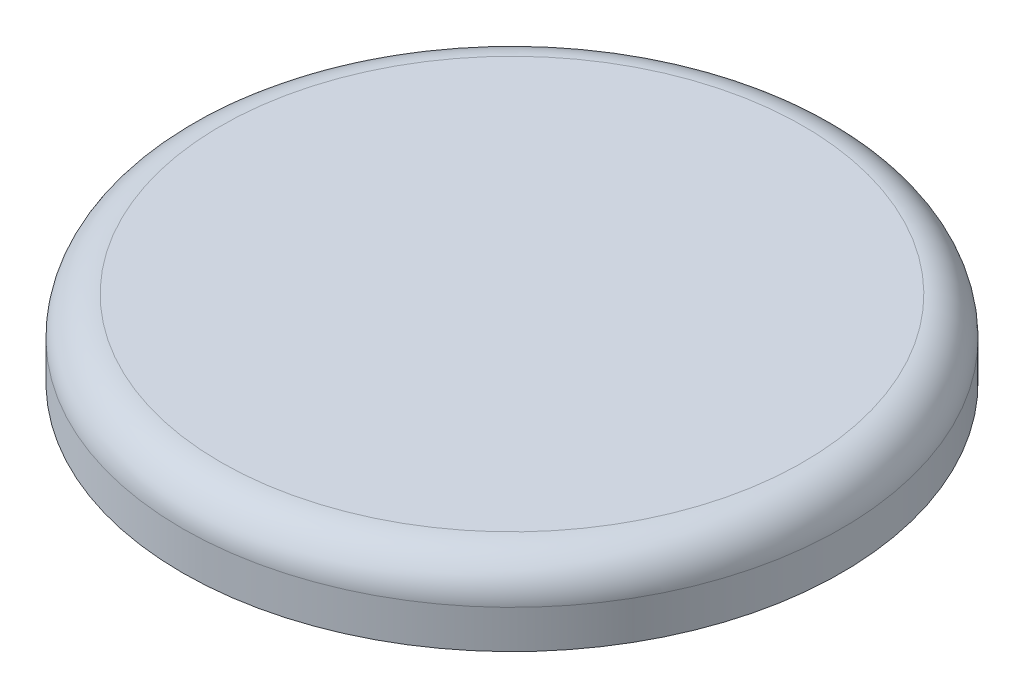
ISO-10303-21;
HEADER;
FILE_DESCRIPTION(('STEP AP214'),'2;1');
FILE_NAME('part.step','',(''),(''),'','','');
FILE_SCHEMA(('AUTOMOTIVE_DESIGN { 1 0 10303 214 1 1 1 1 }'));
ENDSEC;
DATA;
#1=APPLICATION_CONTEXT('core data for automotive mechanical design processes');
#2=APPLICATION_PROTOCOL_DEFINITION('international standard','automotive_design',2000,#1);
#3=PRODUCT_CONTEXT('',#1,'mechanical');
#4=PRODUCT('Part','Part','',(#3));
#5=PRODUCT_RELATED_PRODUCT_CATEGORY('part','',(#4));
#6=PRODUCT_DEFINITION_FORMATION('','',#4);
#7=PRODUCT_DEFINITION_CONTEXT('part definition',#1,'design');
#8=PRODUCT_DEFINITION('design','',#6,#7);
#9=PRODUCT_DEFINITION_SHAPE('','',#8);
#10=(LENGTH_UNIT() NAMED_UNIT(*) SI_UNIT(.MILLI.,.METRE.));
#11=(NAMED_UNIT(*) PLANE_ANGLE_UNIT() SI_UNIT($,.RADIAN.));
#12=(NAMED_UNIT(*) SI_UNIT($,.STERADIAN.) SOLID_ANGLE_UNIT());
#13=UNCERTAINTY_MEASURE_WITH_UNIT(LENGTH_MEASURE(1.E-05),#10,'distance_accuracy_value','');
#14=(GEOMETRIC_REPRESENTATION_CONTEXT(3) GLOBAL_UNCERTAINTY_ASSIGNED_CONTEXT((#13)) GLOBAL_UNIT_ASSIGNED_CONTEXT((#10,
#11,#12)) REPRESENTATION_CONTEXT('',''));
#15=CARTESIAN_POINT('',(0.,0.,0.));
#16=DIRECTION('',(0.,0.,1.));
#17=DIRECTION('',(1.,0.,0.));
#18=AXIS2_PLACEMENT_3D('',#15,#16,#17);
#19=CARTESIAN_POINT('',(0.,2.,0.));
#20=DIRECTION('',(0.,-1.,0.));
#21=DIRECTION('',(0.,0.,-1.));
#22=AXIS2_PLACEMENT_3D('',#19,#20,#21);
#23=CYLINDRICAL_SURFACE('',#22,8.6);
#24=CARTESIAN_POINT('',(0.,1.,0.));
#25=DIRECTION('',(0.,1.,0.));
#26=DIRECTION('',(0.,0.,1.));
#27=AXIS2_PLACEMENT_3D('',#24,#25,#26);
#28=CIRCLE('',#27,8.6);
#29=CARTESIAN_POINT('',(0.,1.,8.6));
#30=VERTEX_POINT('',#29);
#31=EDGE_CURVE('E10',#30,#30,#28,.F.);
#32=ORIENTED_EDGE('',*,*,#31,.T.);
#33=EDGE_LOOP('',(#32));
#34=FACE_BOUND('',#33,.T.);
#35=CARTESIAN_POINT('',(0.,0.,0.));
#36=DIRECTION('',(0.,1.,0.));
#37=DIRECTION('',(0.,0.,1.));
#38=AXIS2_PLACEMENT_3D('',#35,#36,#37);
#39=CIRCLE('',#38,8.6);
#40=CARTESIAN_POINT('',(0.,0.,8.6));
#41=VERTEX_POINT('',#40);
#42=EDGE_CURVE('E50',#41,#41,#39,.T.);
#43=ORIENTED_EDGE('',*,*,#42,.T.);
#44=EDGE_LOOP('',(#43));
#45=FACE_BOUND('',#44,.T.);
#46=ADVANCED_FACE('F37',(#34,#45),#23,.T.);
#47=CARTESIAN_POINT('',(0.,2.,0.));
#48=DIRECTION('',(0.,1.,0.));
#49=DIRECTION('',(0.,0.,1.));
#50=AXIS2_PLACEMENT_3D('',#47,#48,#49);
#51=PLANE('',#50);
#52=CARTESIAN_POINT('',(0.,2.,0.));
#53=DIRECTION('',(0.,1.,0.));
#54=DIRECTION('',(0.,0.,1.));
#55=AXIS2_PLACEMENT_3D('',#52,#53,#54);
#56=CIRCLE('',#55,7.6);
#57=CARTESIAN_POINT('',(0.,2.,7.6));
#58=VERTEX_POINT('',#57);
#59=EDGE_CURVE('E45',#58,#58,#56,.T.);
#60=ORIENTED_EDGE('',*,*,#59,.T.);
#61=EDGE_LOOP('',(#60));
#62=FACE_BOUND('',#61,.T.);
#63=ADVANCED_FACE('F83',(#62),#51,.T.);
#64=CARTESIAN_POINT('',(0.,0.,0.));
#65=DIRECTION('',(0.,1.,0.));
#66=DIRECTION('',(0.,0.,1.));
#67=AXIS2_PLACEMENT_3D('',#64,#65,#66);
#68=PLANE('',#67);
#69=CARTESIAN_POINT('',(0.,0.,0.));
#70=DIRECTION('',(0.,1.,0.));
#71=DIRECTION('',(0.,0.,1.));
#72=AXIS2_PLACEMENT_3D('',#69,#70,#71);
#73=CIRCLE('',#72,8.4);
#74=CARTESIAN_POINT('',(0.,0.,8.4));
#75=VERTEX_POINT('',#74);
#76=EDGE_CURVE('E58',#75,#75,#73,.T.);
#77=ORIENTED_EDGE('',*,*,#76,.T.);
#78=EDGE_LOOP('',(#77));
#79=FACE_BOUND('',#78,.T.);
#80=ORIENTED_EDGE('',*,*,#42,.F.);
#81=EDGE_LOOP('',(#80));
#82=FACE_BOUND('',#81,.T.);
#83=ADVANCED_FACE('F80',(#79,#82),#68,.F.);
#84=CARTESIAN_POINT('',(0.,1.,0.));
#85=DIRECTION('',(0.,1.,0.));
#86=DIRECTION('',(0.,0.,1.));
#87=AXIS2_PLACEMENT_3D('',#84,#85,#86);
#88=TOROIDAL_SURFACE('',#87,7.6,1.);
#89=ORIENTED_EDGE('',*,*,#31,.F.);
#90=EDGE_LOOP('',(#89));
#91=FACE_BOUND('',#90,.T.);
#92=ORIENTED_EDGE('',*,*,#59,.F.);
#93=EDGE_LOOP('',(#92));
#94=FACE_BOUND('',#93,.T.);
#95=ADVANCED_FACE('F39',(#91,#94),#88,.T.);
#96=CARTESIAN_POINT('',(0.,2.,0.));
#97=DIRECTION('',(0.,-1.,0.));
#98=DIRECTION('',(0.,0.,-1.));
#99=AXIS2_PLACEMENT_3D('',#96,#97,#98);
#100=CYLINDRICAL_SURFACE('',#99,8.4);
#101=CARTESIAN_POINT('',(0.,1.,0.));
#102=DIRECTION('',(0.,-1.,0.));
#103=DIRECTION('',(0.,0.,-1.));
#104=AXIS2_PLACEMENT_3D('',#101,#102,#103);
#105=CIRCLE('',#104,8.4);
#106=CARTESIAN_POINT('',(0.,1.,-8.4));
#107=VERTEX_POINT('',#106);
#108=EDGE_CURVE('E55',#107,#107,#105,.T.);
#109=ORIENTED_EDGE('',*,*,#108,.F.);
#110=EDGE_LOOP('',(#109));
#111=FACE_BOUND('',#110,.T.);
#112=ORIENTED_EDGE('',*,*,#76,.F.);
#113=EDGE_LOOP('',(#112));
#114=FACE_BOUND('',#113,.T.);
#115=ADVANCED_FACE('F73',(#111,#114),#100,.F.);
#116=CARTESIAN_POINT('',(0.,1.8,0.));
#117=DIRECTION('',(0.,1.,0.));
#118=DIRECTION('',(0.,0.,1.));
#119=AXIS2_PLACEMENT_3D('',#116,#117,#118);
#120=PLANE('',#119);
#121=CARTESIAN_POINT('',(0.,1.8,0.));
#122=DIRECTION('',(0.,1.,0.));
#123=DIRECTION('',(0.,0.,1.));
#124=AXIS2_PLACEMENT_3D('',#121,#122,#123);
#125=CIRCLE('',#124,7.6);
#126=CARTESIAN_POINT('',(0.,1.8,7.6));
#127=VERTEX_POINT('',#126);
#128=EDGE_CURVE('E62',#127,#127,#125,.T.);
#129=ORIENTED_EDGE('',*,*,#128,.F.);
#130=EDGE_LOOP('',(#129));
#131=FACE_BOUND('',#130,.T.);
#132=ADVANCED_FACE('F76',(#131),#120,.F.);
#133=CARTESIAN_POINT('',(0.,1.,0.));
#134=DIRECTION('',(0.,1.,0.));
#135=DIRECTION('',(0.,0.,1.));
#136=AXIS2_PLACEMENT_3D('',#133,#134,#135);
#137=TOROIDAL_SURFACE('',#136,7.6,0.8);
#138=ORIENTED_EDGE('',*,*,#108,.T.);
#139=EDGE_LOOP('',(#138));
#140=FACE_BOUND('',#139,.T.);
#141=ORIENTED_EDGE('',*,*,#128,.T.);
#142=EDGE_LOOP('',(#141));
#143=FACE_BOUND('',#142,.T.);
#144=ADVANCED_FACE('F70',(#140,#143),#137,.F.);
#145=CLOSED_SHELL('',(#46,#63,#83,#95,#115,#132,#144));
#146=MANIFOLD_SOLID_BREP('B2',#145);
#147=ADVANCED_BREP_SHAPE_REPRESENTATION('',(#18,#146),#14);
#148=SHAPE_DEFINITION_REPRESENTATION(#9,#147);
ENDSEC;
END-ISO-10303-21;
